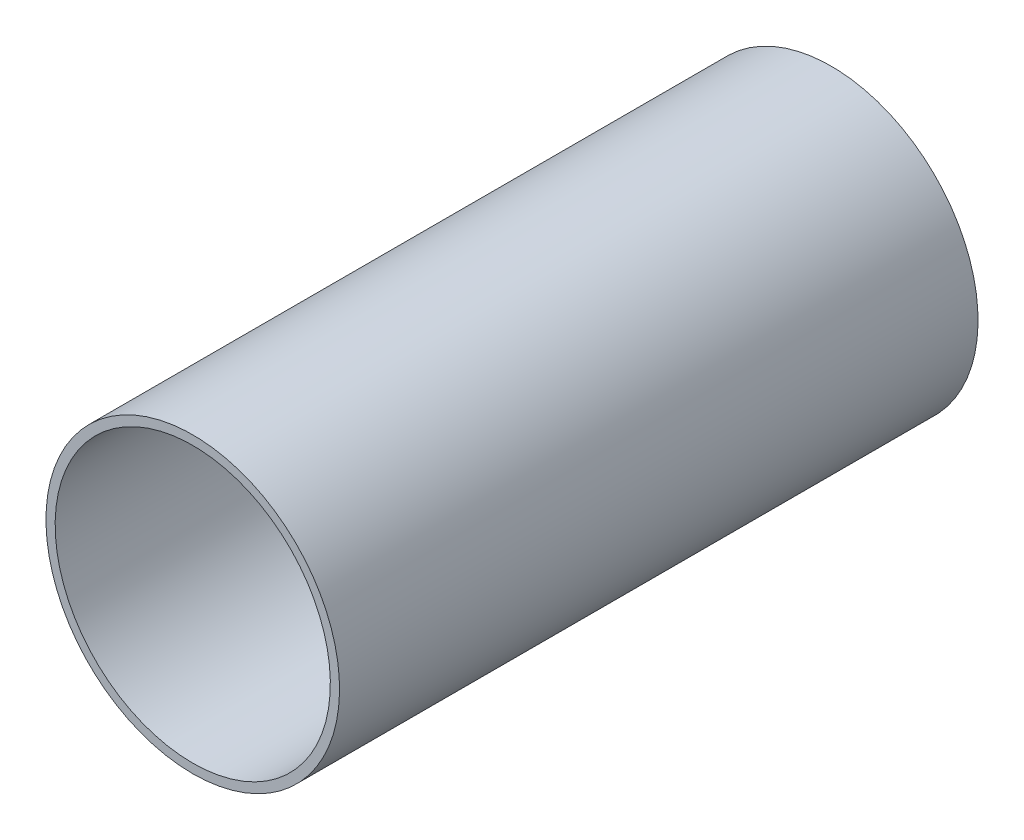
ISO-10303-21;
HEADER;
FILE_DESCRIPTION(('STEP AP214'),'2;1');
FILE_NAME('part.step','',(''),(''),'','','');
FILE_SCHEMA(('AUTOMOTIVE_DESIGN { 1 0 10303 214 1 1 1 1 }'));
ENDSEC;
DATA;
#1=APPLICATION_CONTEXT('core data for automotive mechanical design processes');
#2=APPLICATION_PROTOCOL_DEFINITION('international standard','automotive_design',2000,#1);
#3=PRODUCT_CONTEXT('',#1,'mechanical');
#4=PRODUCT('Part','Part','',(#3));
#5=PRODUCT_RELATED_PRODUCT_CATEGORY('part','',(#4));
#6=PRODUCT_DEFINITION_FORMATION('','',#4);
#7=PRODUCT_DEFINITION_CONTEXT('part definition',#1,'design');
#8=PRODUCT_DEFINITION('design','',#6,#7);
#9=PRODUCT_DEFINITION_SHAPE('','',#8);
#10=(LENGTH_UNIT() NAMED_UNIT(*) SI_UNIT(.MILLI.,.METRE.));
#11=(NAMED_UNIT(*) PLANE_ANGLE_UNIT() SI_UNIT($,.RADIAN.));
#12=(NAMED_UNIT(*) SI_UNIT($,.STERADIAN.) SOLID_ANGLE_UNIT());
#13=UNCERTAINTY_MEASURE_WITH_UNIT(LENGTH_MEASURE(1.E-05),#10,'distance_accuracy_value','');
#14=(GEOMETRIC_REPRESENTATION_CONTEXT(3) GLOBAL_UNCERTAINTY_ASSIGNED_CONTEXT((#13)) GLOBAL_UNIT_ASSIGNED_CONTEXT((#10,
#11,#12)) REPRESENTATION_CONTEXT('',''));
#15=CARTESIAN_POINT('',(0.,0.,0.));
#16=DIRECTION('',(0.,0.,1.));
#17=DIRECTION('',(1.,0.,0.));
#18=AXIS2_PLACEMENT_3D('',#15,#16,#17);
#19=CARTESIAN_POINT('',(149.86,-80.772,-0.045));
#20=DIRECTION('',(0.,0.,-1.));
#21=DIRECTION('',(0.,-1.,0.));
#22=AXIS2_PLACEMENT_3D('',#19,#20,#21);
#23=CYLINDRICAL_SURFACE('',#22,0.375);
#24=CARTESIAN_POINT('',(149.86,-80.772,-0.035));
#25=DIRECTION('',(0.,0.,-1.));
#26=DIRECTION('',(0.,-1.,0.));
#27=AXIS2_PLACEMENT_3D('',#24,#25,#26);
#28=CIRCLE('',#27,0.375);
#29=CARTESIAN_POINT('',(149.86,-81.147,-0.035));
#30=VERTEX_POINT('',#29);
#31=EDGE_CURVE('E65',#30,#30,#28,.T.);
#32=ORIENTED_EDGE('',*,*,#31,.T.);
#33=DIRECTION('',(0.,0.,1.));
#34=VECTOR('',#33,1.);
#35=CARTESIAN_POINT('',(149.86,-81.147,-0.045));
#36=LINE('',#35,#34);
#37=CARTESIAN_POINT('',(149.86,-81.147,1.705));
#38=VERTEX_POINT('',#37);
#39=EDGE_CURVE('E11',#30,#38,#36,.T.);
#40=ORIENTED_EDGE('',*,*,#39,.T.);
#41=CARTESIAN_POINT('',(149.86,-80.772,1.705));
#42=DIRECTION('',(0.,0.,-1.));
#43=DIRECTION('',(0.,-1.,0.));
#44=AXIS2_PLACEMENT_3D('',#41,#42,#43);
#45=CIRCLE('',#44,0.375);
#46=EDGE_CURVE('E26',#38,#38,#45,.T.);
#47=ORIENTED_EDGE('',*,*,#46,.F.);
#48=ORIENTED_EDGE('',*,*,#39,.F.);
#49=EDGE_LOOP('',(#32,#40,#47,#48));
#50=FACE_BOUND('',#49,.T.);
#51=ADVANCED_FACE('F17',(#50),#23,.F.);
#52=CARTESIAN_POINT('',(149.86,-81.172,1.705));
#53=DIRECTION('',(0.,0.,1.));
#54=DIRECTION('',(1.,0.,0.));
#55=AXIS2_PLACEMENT_3D('',#52,#53,#54);
#56=PLANE('',#55);
#57=ORIENTED_EDGE('',*,*,#46,.T.);
#58=EDGE_LOOP('',(#57));
#59=FACE_BOUND('',#58,.T.);
#60=CARTESIAN_POINT('',(149.86,-80.772,1.705));
#61=DIRECTION('',(0.,0.,1.));
#62=DIRECTION('',(0.,-1.,0.));
#63=AXIS2_PLACEMENT_3D('',#60,#61,#62);
#64=CIRCLE('',#63,0.4);
#65=CARTESIAN_POINT('',(149.86,-81.172,1.705));
#66=VERTEX_POINT('',#65);
#67=EDGE_CURVE('E57',#66,#66,#64,.T.);
#68=ORIENTED_EDGE('',*,*,#67,.T.);
#69=EDGE_LOOP('',(#68));
#70=FACE_BOUND('',#69,.T.);
#71=ADVANCED_FACE('F19',(#59,#70),#56,.T.);
#72=CARTESIAN_POINT('',(149.86,-81.172,-0.035));
#73=DIRECTION('',(0.,0.,1.));
#74=DIRECTION('',(1.,0.,0.));
#75=AXIS2_PLACEMENT_3D('',#72,#73,#74);
#76=PLANE('',#75);
#77=ORIENTED_EDGE('',*,*,#31,.F.);
#78=EDGE_LOOP('',(#77));
#79=FACE_BOUND('',#78,.T.);
#80=CARTESIAN_POINT('',(149.86,-80.772,-0.035));
#81=DIRECTION('',(0.,0.,1.));
#82=DIRECTION('',(0.,-1.,0.));
#83=AXIS2_PLACEMENT_3D('',#80,#81,#82);
#84=CIRCLE('',#83,0.4);
#85=CARTESIAN_POINT('',(149.86,-81.172,-0.035));
#86=VERTEX_POINT('',#85);
#87=EDGE_CURVE('E56',#86,#86,#84,.T.);
#88=ORIENTED_EDGE('',*,*,#87,.F.);
#89=EDGE_LOOP('',(#88));
#90=FACE_BOUND('',#89,.T.);
#91=ADVANCED_FACE('F83',(#79,#90),#76,.F.);
#92=CARTESIAN_POINT('',(149.86,-80.772,-0.035));
#93=DIRECTION('',(0.,0.,-1.));
#94=DIRECTION('',(0.,-1.,0.));
#95=AXIS2_PLACEMENT_3D('',#92,#93,#94);
#96=CYLINDRICAL_SURFACE('',#95,0.4);
#97=ORIENTED_EDGE('',*,*,#87,.T.);
#98=DIRECTION('',(0.,0.,1.));
#99=VECTOR('',#98,1.);
#100=CARTESIAN_POINT('',(149.86,-81.172,-0.035));
#101=LINE('',#100,#99);
#102=EDGE_CURVE('E53',#86,#66,#101,.T.);
#103=ORIENTED_EDGE('',*,*,#102,.T.);
#104=ORIENTED_EDGE('',*,*,#67,.F.);
#105=ORIENTED_EDGE('',*,*,#102,.F.);
#106=EDGE_LOOP('',(#97,#103,#104,#105));
#107=FACE_BOUND('',#106,.T.);
#108=ADVANCED_FACE('F54',(#107),#96,.T.);
#109=CLOSED_SHELL('',(#51,#71,#91,#108));
#110=MANIFOLD_SOLID_BREP('B1',#109);
#111=ADVANCED_BREP_SHAPE_REPRESENTATION('',(#18,#110),#14);
#112=SHAPE_DEFINITION_REPRESENTATION(#9,#111);
ENDSEC;
END-ISO-10303-21;
